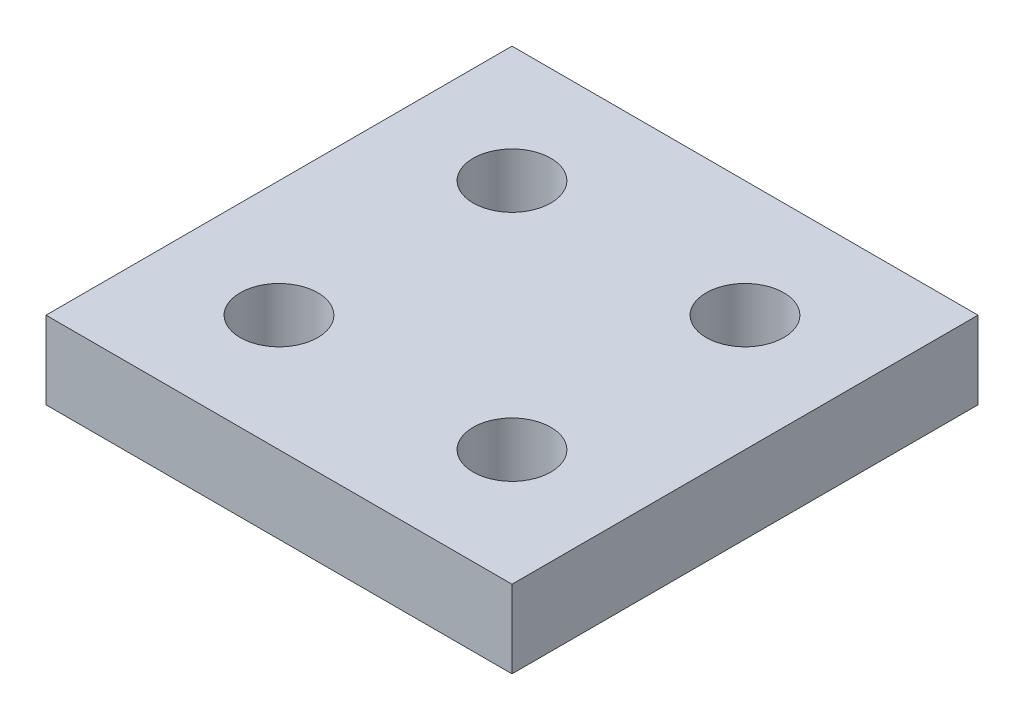
ISO-10303-21;
HEADER;
FILE_DESCRIPTION(('STEP AP214'),'2;1');
FILE_NAME('part.step','',(''),(''),'','','');
FILE_SCHEMA(('AUTOMOTIVE_DESIGN { 1 0 10303 214 1 1 1 1 }'));
ENDSEC;
DATA;
#1=APPLICATION_CONTEXT('core data for automotive mechanical design processes');
#2=APPLICATION_PROTOCOL_DEFINITION('international standard','automotive_design',2000,#1);
#3=PRODUCT_CONTEXT('',#1,'mechanical');
#4=PRODUCT('Part','Part','',(#3));
#5=PRODUCT_RELATED_PRODUCT_CATEGORY('part','',(#4));
#6=PRODUCT_DEFINITION_FORMATION('','',#4);
#7=PRODUCT_DEFINITION_CONTEXT('part definition',#1,'design');
#8=PRODUCT_DEFINITION('design','',#6,#7);
#9=PRODUCT_DEFINITION_SHAPE('','',#8);
#10=(LENGTH_UNIT() NAMED_UNIT(*) SI_UNIT(.MILLI.,.METRE.));
#11=(NAMED_UNIT(*) PLANE_ANGLE_UNIT() SI_UNIT($,.RADIAN.));
#12=(NAMED_UNIT(*) SI_UNIT($,.STERADIAN.) SOLID_ANGLE_UNIT());
#13=UNCERTAINTY_MEASURE_WITH_UNIT(LENGTH_MEASURE(1.E-05),#10,'distance_accuracy_value','');
#14=(GEOMETRIC_REPRESENTATION_CONTEXT(3) GLOBAL_UNCERTAINTY_ASSIGNED_CONTEXT((#13)) GLOBAL_UNIT_ASSIGNED_CONTEXT((#10,
#11,#12)) REPRESENTATION_CONTEXT('',''));
#15=CARTESIAN_POINT('',(0.,0.,0.));
#16=DIRECTION('',(0.,0.,1.));
#17=DIRECTION('',(1.,0.,0.));
#18=AXIS2_PLACEMENT_3D('',#15,#16,#17);
#19=CARTESIAN_POINT('',(0.,10.,0.));
#20=DIRECTION('',(1.,0.,0.));
#21=DIRECTION('',(0.,0.,-1.));
#22=AXIS2_PLACEMENT_3D('',#19,#20,#21);
#23=PLANE('',#22);
#24=DIRECTION('',(0.,0.,1.));
#25=VECTOR('',#24,1.);
#26=CARTESIAN_POINT('',(0.,0.,0.));
#27=LINE('',#26,#25);
#28=CARTESIAN_POINT('',(0.,0.,-60.));
#29=VERTEX_POINT('',#28);
#30=CARTESIAN_POINT('',(0.,0.,0.));
#31=VERTEX_POINT('',#30);
#32=EDGE_CURVE('E95',#29,#31,#27,.T.);
#33=ORIENTED_EDGE('',*,*,#32,.T.);
#34=DIRECTION('',(0.,-1.,0.));
#35=VECTOR('',#34,1.);
#36=CARTESIAN_POINT('',(0.,10.,0.));
#37=LINE('',#36,#35);
#38=CARTESIAN_POINT('',(0.,10.,0.));
#39=VERTEX_POINT('',#38);
#40=EDGE_CURVE('E11',#39,#31,#37,.T.);
#41=ORIENTED_EDGE('',*,*,#40,.F.);
#42=DIRECTION('',(0.,0.,1.));
#43=VECTOR('',#42,1.);
#44=CARTESIAN_POINT('',(0.,10.,0.));
#45=LINE('',#44,#43);
#46=CARTESIAN_POINT('',(0.,10.,-60.));
#47=VERTEX_POINT('',#46);
#48=EDGE_CURVE('E83',#47,#39,#45,.T.);
#49=ORIENTED_EDGE('',*,*,#48,.F.);
#50=DIRECTION('',(0.,-1.,0.));
#51=VECTOR('',#50,1.);
#52=CARTESIAN_POINT('',(0.,10.,-60.));
#53=LINE('',#52,#51);
#54=EDGE_CURVE('E91',#47,#29,#53,.T.);
#55=ORIENTED_EDGE('',*,*,#54,.T.);
#56=EDGE_LOOP('',(#33,#41,#49,#55));
#57=FACE_BOUND('',#56,.T.);
#58=ADVANCED_FACE('F32',(#57),#23,.F.);
#59=CARTESIAN_POINT('',(0.,10.,0.));
#60=DIRECTION('',(0.,0.,-1.));
#61=DIRECTION('',(-1.,0.,0.));
#62=AXIS2_PLACEMENT_3D('',#59,#60,#61);
#63=PLANE('',#62);
#64=DIRECTION('',(1.,0.,0.));
#65=VECTOR('',#64,1.);
#66=CARTESIAN_POINT('',(0.,0.,0.));
#67=LINE('',#66,#65);
#68=CARTESIAN_POINT('',(60.,0.,0.));
#69=VERTEX_POINT('',#68);
#70=EDGE_CURVE('E87',#31,#69,#67,.T.);
#71=ORIENTED_EDGE('',*,*,#70,.T.);
#72=DIRECTION('',(0.,-1.,0.));
#73=VECTOR('',#72,1.);
#74=CARTESIAN_POINT('',(60.,10.,0.));
#75=LINE('',#74,#73);
#76=CARTESIAN_POINT('',(60.,10.,0.));
#77=VERTEX_POINT('',#76);
#78=EDGE_CURVE('E40',#77,#69,#75,.T.);
#79=ORIENTED_EDGE('',*,*,#78,.F.);
#80=DIRECTION('',(1.,0.,0.));
#81=VECTOR('',#80,1.);
#82=CARTESIAN_POINT('',(0.,10.,0.));
#83=LINE('',#82,#81);
#84=EDGE_CURVE('E78',#39,#77,#83,.T.);
#85=ORIENTED_EDGE('',*,*,#84,.F.);
#86=ORIENTED_EDGE('',*,*,#40,.T.);
#87=EDGE_LOOP('',(#71,#79,#85,#86));
#88=FACE_BOUND('',#87,.T.);
#89=ADVANCED_FACE('F86',(#88),#63,.F.);
#90=CARTESIAN_POINT('',(60.,10.,0.));
#91=DIRECTION('',(-1.,0.,0.));
#92=DIRECTION('',(0.,0.,1.));
#93=AXIS2_PLACEMENT_3D('',#90,#91,#92);
#94=PLANE('',#93);
#95=DIRECTION('',(0.,0.,-1.));
#96=VECTOR('',#95,1.);
#97=CARTESIAN_POINT('',(60.,0.,0.));
#98=LINE('',#97,#96);
#99=CARTESIAN_POINT('',(60.,0.,-60.));
#100=VERTEX_POINT('',#99);
#101=EDGE_CURVE('E65',#69,#100,#98,.T.);
#102=ORIENTED_EDGE('',*,*,#101,.T.);
#103=DIRECTION('',(0.,-1.,0.));
#104=VECTOR('',#103,1.);
#105=CARTESIAN_POINT('',(60.,10.,-60.));
#106=LINE('',#105,#104);
#107=CARTESIAN_POINT('',(60.,10.,-60.));
#108=VERTEX_POINT('',#107);
#109=EDGE_CURVE('E88',#108,#100,#106,.T.);
#110=ORIENTED_EDGE('',*,*,#109,.F.);
#111=DIRECTION('',(0.,0.,-1.));
#112=VECTOR('',#111,1.);
#113=CARTESIAN_POINT('',(60.,10.,0.));
#114=LINE('',#113,#112);
#115=EDGE_CURVE('E81',#77,#108,#114,.T.);
#116=ORIENTED_EDGE('',*,*,#115,.F.);
#117=ORIENTED_EDGE('',*,*,#78,.T.);
#118=EDGE_LOOP('',(#102,#110,#116,#117));
#119=FACE_BOUND('',#118,.T.);
#120=ADVANCED_FACE('F89',(#119),#94,.F.);
#121=CARTESIAN_POINT('',(0.,10.,-60.));
#122=DIRECTION('',(0.,0.,1.));
#123=DIRECTION('',(1.,0.,0.));
#124=AXIS2_PLACEMENT_3D('',#121,#122,#123);
#125=PLANE('',#124);
#126=DIRECTION('',(-1.,0.,0.));
#127=VECTOR('',#126,1.);
#128=CARTESIAN_POINT('',(0.,0.,-60.));
#129=LINE('',#128,#127);
#130=EDGE_CURVE('E71',#100,#29,#129,.T.);
#131=ORIENTED_EDGE('',*,*,#130,.T.);
#132=ORIENTED_EDGE('',*,*,#54,.F.);
#133=DIRECTION('',(-1.,0.,0.));
#134=VECTOR('',#133,1.);
#135=CARTESIAN_POINT('',(0.,10.,-60.));
#136=LINE('',#135,#134);
#137=EDGE_CURVE('E48',#108,#47,#136,.T.);
#138=ORIENTED_EDGE('',*,*,#137,.F.);
#139=ORIENTED_EDGE('',*,*,#109,.T.);
#140=EDGE_LOOP('',(#131,#132,#138,#139));
#141=FACE_BOUND('',#140,.T.);
#142=ADVANCED_FACE('F103',(#141),#125,.F.);
#143=CARTESIAN_POINT('',(0.,10.,0.));
#144=DIRECTION('',(0.,-1.,0.));
#145=DIRECTION('',(0.,0.,-1.));
#146=AXIS2_PLACEMENT_3D('',#143,#144,#145);
#147=PLANE('',#146);
#148=CARTESIAN_POINT('',(45.,10.,-45.));
#149=DIRECTION('',(0.,1.,0.));
#150=DIRECTION('',(0.,0.,1.));
#151=AXIS2_PLACEMENT_3D('',#148,#149,#150);
#152=CIRCLE('',#151,5.);
#153=CARTESIAN_POINT('',(45.,10.,-40.));
#154=VERTEX_POINT('',#153);
#155=EDGE_CURVE('E127',#154,#154,#152,.T.);
#156=ORIENTED_EDGE('',*,*,#155,.F.);
#157=EDGE_LOOP('',(#156));
#158=FACE_BOUND('',#157,.T.);
#159=CARTESIAN_POINT('',(45.,10.,-15.));
#160=DIRECTION('',(0.,1.,0.));
#161=DIRECTION('',(0.,0.,1.));
#162=AXIS2_PLACEMENT_3D('',#159,#160,#161);
#163=CIRCLE('',#162,5.);
#164=CARTESIAN_POINT('',(45.,10.,-10.));
#165=VERTEX_POINT('',#164);
#166=EDGE_CURVE('E121',#165,#165,#163,.T.);
#167=ORIENTED_EDGE('',*,*,#166,.F.);
#168=EDGE_LOOP('',(#167));
#169=FACE_BOUND('',#168,.T.);
#170=CARTESIAN_POINT('',(15.,10.,-45.));
#171=DIRECTION('',(0.,1.,0.));
#172=DIRECTION('',(0.,0.,1.));
#173=AXIS2_PLACEMENT_3D('',#170,#171,#172);
#174=CIRCLE('',#173,5.);
#175=CARTESIAN_POINT('',(15.,10.,-40.));
#176=VERTEX_POINT('',#175);
#177=EDGE_CURVE('E115',#176,#176,#174,.T.);
#178=ORIENTED_EDGE('',*,*,#177,.F.);
#179=EDGE_LOOP('',(#178));
#180=FACE_BOUND('',#179,.T.);
#181=CARTESIAN_POINT('',(15.,10.,-15.));
#182=DIRECTION('',(0.,1.,0.));
#183=DIRECTION('',(0.,0.,1.));
#184=AXIS2_PLACEMENT_3D('',#181,#182,#183);
#185=CIRCLE('',#184,5.);
#186=CARTESIAN_POINT('',(15.,10.,-10.));
#187=VERTEX_POINT('',#186);
#188=EDGE_CURVE('E109',#187,#187,#185,.T.);
#189=ORIENTED_EDGE('',*,*,#188,.F.);
#190=EDGE_LOOP('',(#189));
#191=FACE_BOUND('',#190,.T.);
#192=ORIENTED_EDGE('',*,*,#48,.T.);
#193=ORIENTED_EDGE('',*,*,#84,.T.);
#194=ORIENTED_EDGE('',*,*,#115,.T.);
#195=ORIENTED_EDGE('',*,*,#137,.T.);
#196=EDGE_LOOP('',(#192,#193,#194,#195));
#197=FACE_BOUND('',#196,.T.);
#198=ADVANCED_FACE('F79',(#158,#169,#180,#191,#197),#147,.F.);
#199=CARTESIAN_POINT('',(0.,0.,0.));
#200=DIRECTION('',(0.,-1.,0.));
#201=DIRECTION('',(0.,0.,-1.));
#202=AXIS2_PLACEMENT_3D('',#199,#200,#201);
#203=PLANE('',#202);
#204=CARTESIAN_POINT('',(45.,0.,-45.));
#205=DIRECTION('',(0.,1.,0.));
#206=DIRECTION('',(0.,0.,1.));
#207=AXIS2_PLACEMENT_3D('',#204,#205,#206);
#208=CIRCLE('',#207,5.);
#209=CARTESIAN_POINT('',(45.,0.,-40.));
#210=VERTEX_POINT('',#209);
#211=EDGE_CURVE('E124',#210,#210,#208,.T.);
#212=ORIENTED_EDGE('',*,*,#211,.T.);
#213=EDGE_LOOP('',(#212));
#214=FACE_BOUND('',#213,.T.);
#215=CARTESIAN_POINT('',(45.,0.,-15.));
#216=DIRECTION('',(0.,1.,0.));
#217=DIRECTION('',(0.,0.,1.));
#218=AXIS2_PLACEMENT_3D('',#215,#216,#217);
#219=CIRCLE('',#218,5.);
#220=CARTESIAN_POINT('',(45.,0.,-10.));
#221=VERTEX_POINT('',#220);
#222=EDGE_CURVE('E118',#221,#221,#219,.T.);
#223=ORIENTED_EDGE('',*,*,#222,.T.);
#224=EDGE_LOOP('',(#223));
#225=FACE_BOUND('',#224,.T.);
#226=CARTESIAN_POINT('',(15.,0.,-45.));
#227=DIRECTION('',(0.,1.,0.));
#228=DIRECTION('',(0.,0.,1.));
#229=AXIS2_PLACEMENT_3D('',#226,#227,#228);
#230=CIRCLE('',#229,5.);
#231=CARTESIAN_POINT('',(15.,0.,-40.));
#232=VERTEX_POINT('',#231);
#233=EDGE_CURVE('E112',#232,#232,#230,.T.);
#234=ORIENTED_EDGE('',*,*,#233,.T.);
#235=EDGE_LOOP('',(#234));
#236=FACE_BOUND('',#235,.T.);
#237=CARTESIAN_POINT('',(15.,0.,-15.));
#238=DIRECTION('',(0.,1.,0.));
#239=DIRECTION('',(0.,0.,1.));
#240=AXIS2_PLACEMENT_3D('',#237,#238,#239);
#241=CIRCLE('',#240,5.);
#242=CARTESIAN_POINT('',(15.,0.,-10.));
#243=VERTEX_POINT('',#242);
#244=EDGE_CURVE('E98',#243,#243,#241,.T.);
#245=ORIENTED_EDGE('',*,*,#244,.T.);
#246=EDGE_LOOP('',(#245));
#247=FACE_BOUND('',#246,.T.);
#248=ORIENTED_EDGE('',*,*,#32,.F.);
#249=ORIENTED_EDGE('',*,*,#130,.F.);
#250=ORIENTED_EDGE('',*,*,#101,.F.);
#251=ORIENTED_EDGE('',*,*,#70,.F.);
#252=EDGE_LOOP('',(#248,#249,#250,#251));
#253=FACE_BOUND('',#252,.T.);
#254=ADVANCED_FACE('F106',(#214,#225,#236,#247,#253),#203,.T.);
#255=CARTESIAN_POINT('',(15.,0.,-15.));
#256=DIRECTION('',(0.,1.,0.));
#257=DIRECTION('',(0.,0.,1.));
#258=AXIS2_PLACEMENT_3D('',#255,#256,#257);
#259=CYLINDRICAL_SURFACE('',#258,5.);
#260=ORIENTED_EDGE('',*,*,#244,.F.);
#261=EDGE_LOOP('',(#260));
#262=FACE_BOUND('',#261,.T.);
#263=ORIENTED_EDGE('',*,*,#188,.T.);
#264=EDGE_LOOP('',(#263));
#265=FACE_BOUND('',#264,.T.);
#266=ADVANCED_FACE('F151',(#262,#265),#259,.F.);
#267=CARTESIAN_POINT('',(15.,0.,-45.));
#268=DIRECTION('',(0.,1.,0.));
#269=DIRECTION('',(0.,0.,1.));
#270=AXIS2_PLACEMENT_3D('',#267,#268,#269);
#271=CYLINDRICAL_SURFACE('',#270,5.);
#272=ORIENTED_EDGE('',*,*,#233,.F.);
#273=EDGE_LOOP('',(#272));
#274=FACE_BOUND('',#273,.T.);
#275=ORIENTED_EDGE('',*,*,#177,.T.);
#276=EDGE_LOOP('',(#275));
#277=FACE_BOUND('',#276,.T.);
#278=ADVANCED_FACE('F153',(#274,#277),#271,.F.);
#279=CARTESIAN_POINT('',(45.,0.,-15.));
#280=DIRECTION('',(0.,1.,0.));
#281=DIRECTION('',(0.,0.,1.));
#282=AXIS2_PLACEMENT_3D('',#279,#280,#281);
#283=CYLINDRICAL_SURFACE('',#282,5.);
#284=ORIENTED_EDGE('',*,*,#222,.F.);
#285=EDGE_LOOP('',(#284));
#286=FACE_BOUND('',#285,.T.);
#287=ORIENTED_EDGE('',*,*,#166,.T.);
#288=EDGE_LOOP('',(#287));
#289=FACE_BOUND('',#288,.T.);
#290=ADVANCED_FACE('F138',(#286,#289),#283,.F.);
#291=CARTESIAN_POINT('',(45.,0.,-45.));
#292=DIRECTION('',(0.,1.,0.));
#293=DIRECTION('',(0.,0.,1.));
#294=AXIS2_PLACEMENT_3D('',#291,#292,#293);
#295=CYLINDRICAL_SURFACE('',#294,5.);
#296=ORIENTED_EDGE('',*,*,#211,.F.);
#297=EDGE_LOOP('',(#296));
#298=FACE_BOUND('',#297,.T.);
#299=ORIENTED_EDGE('',*,*,#155,.T.);
#300=EDGE_LOOP('',(#299));
#301=FACE_BOUND('',#300,.T.);
#302=ADVANCED_FACE('F135',(#298,#301),#295,.F.);
#303=CLOSED_SHELL('',(#58,#89,#120,#142,#198,#254,#266,#278,#290,#302));
#304=MANIFOLD_SOLID_BREP('B2',#303);
#305=ADVANCED_BREP_SHAPE_REPRESENTATION('',(#18,#304),#14);
#306=SHAPE_DEFINITION_REPRESENTATION(#9,#305);
ENDSEC;
END-ISO-10303-21;
